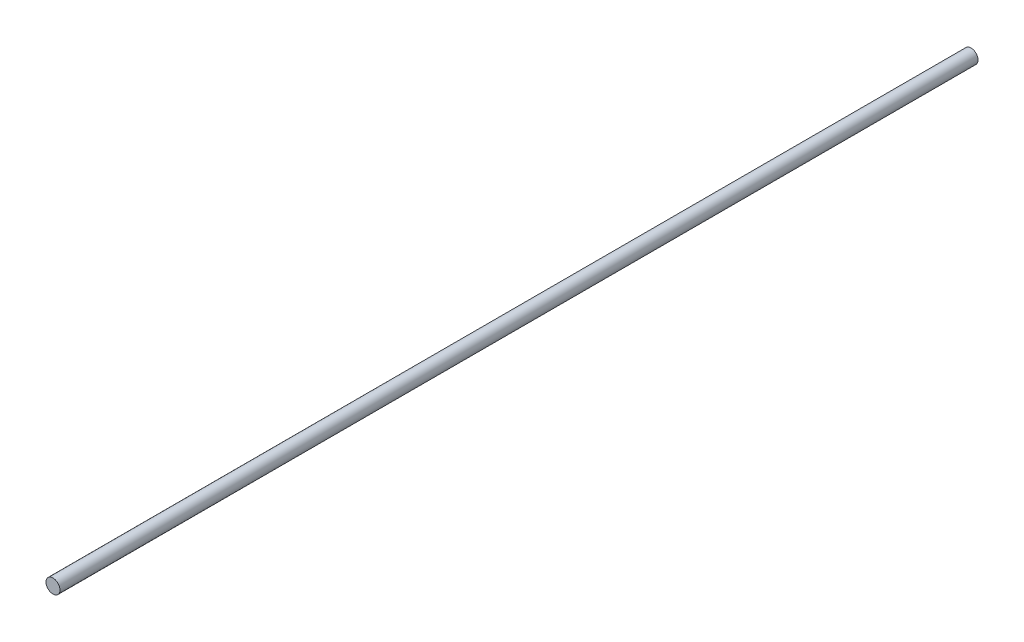
ISO-10303-21;
HEADER;
FILE_DESCRIPTION(('STEP AP214'),'2;1');
FILE_NAME('part.step','',(''),(''),'','','');
FILE_SCHEMA(('AUTOMOTIVE_DESIGN { 1 0 10303 214 1 1 1 1 }'));
ENDSEC;
DATA;
#1=APPLICATION_CONTEXT('core data for automotive mechanical design processes');
#2=APPLICATION_PROTOCOL_DEFINITION('international standard','automotive_design',2000,#1);
#3=PRODUCT_CONTEXT('',#1,'mechanical');
#4=PRODUCT('Part','Part','',(#3));
#5=PRODUCT_RELATED_PRODUCT_CATEGORY('part','',(#4));
#6=PRODUCT_DEFINITION_FORMATION('','',#4);
#7=PRODUCT_DEFINITION_CONTEXT('part definition',#1,'design');
#8=PRODUCT_DEFINITION('design','',#6,#7);
#9=PRODUCT_DEFINITION_SHAPE('','',#8);
#10=(LENGTH_UNIT() NAMED_UNIT(*) SI_UNIT(.MILLI.,.METRE.));
#11=(NAMED_UNIT(*) PLANE_ANGLE_UNIT() SI_UNIT($,.RADIAN.));
#12=(NAMED_UNIT(*) SI_UNIT($,.STERADIAN.) SOLID_ANGLE_UNIT());
#13=UNCERTAINTY_MEASURE_WITH_UNIT(LENGTH_MEASURE(1.E-05),#10,'distance_accuracy_value','');
#14=(GEOMETRIC_REPRESENTATION_CONTEXT(3) GLOBAL_UNCERTAINTY_ASSIGNED_CONTEXT((#13)) GLOBAL_UNIT_ASSIGNED_CONTEXT((#10,
#11,#12)) REPRESENTATION_CONTEXT('',''));
#15=CARTESIAN_POINT('',(0.,0.,0.));
#16=DIRECTION('',(0.,0.,1.));
#17=DIRECTION('',(1.,0.,0.));
#18=AXIS2_PLACEMENT_3D('',#15,#16,#17);
#19=CARTESIAN_POINT('',(0.,0.,635.));
#20=DIRECTION('',(0.,0.,-1.));
#21=DIRECTION('',(-1.,0.,0.));
#22=AXIS2_PLACEMENT_3D('',#19,#20,#21);
#23=CYLINDRICAL_SURFACE('',#22,4.826);
#24=CARTESIAN_POINT('',(0.,0.,635.));
#25=DIRECTION('',(0.,0.,1.));
#26=DIRECTION('',(1.,0.,0.));
#27=AXIS2_PLACEMENT_3D('',#24,#25,#26);
#28=CIRCLE('',#27,4.826);
#29=CARTESIAN_POINT('',(4.826,0.,635.));
#30=VERTEX_POINT('',#29);
#31=EDGE_CURVE('E10',#30,#30,#28,.T.);
#32=ORIENTED_EDGE('',*,*,#31,.F.);
#33=EDGE_LOOP('',(#32));
#34=FACE_BOUND('',#33,.T.);
#35=CARTESIAN_POINT('',(0.,0.,0.));
#36=DIRECTION('',(0.,0.,1.));
#37=DIRECTION('',(1.,0.,0.));
#38=AXIS2_PLACEMENT_3D('',#35,#36,#37);
#39=CIRCLE('',#38,4.826);
#40=CARTESIAN_POINT('',(4.826,0.,0.));
#41=VERTEX_POINT('',#40);
#42=EDGE_CURVE('E34',#41,#41,#39,.T.);
#43=ORIENTED_EDGE('',*,*,#42,.T.);
#44=EDGE_LOOP('',(#43));
#45=FACE_BOUND('',#44,.T.);
#46=ADVANCED_FACE('F31',(#34,#45),#23,.T.);
#47=CARTESIAN_POINT('',(0.,0.,635.));
#48=DIRECTION('',(0.,0.,1.));
#49=DIRECTION('',(1.,0.,0.));
#50=AXIS2_PLACEMENT_3D('',#47,#48,#49);
#51=PLANE('',#50);
#52=ORIENTED_EDGE('',*,*,#31,.T.);
#53=EDGE_LOOP('',(#52));
#54=FACE_BOUND('',#53,.T.);
#55=ADVANCED_FACE('F46',(#54),#51,.T.);
#56=CARTESIAN_POINT('',(0.,0.,0.));
#57=DIRECTION('',(0.,0.,1.));
#58=DIRECTION('',(1.,0.,0.));
#59=AXIS2_PLACEMENT_3D('',#56,#57,#58);
#60=PLANE('',#59);
#61=ORIENTED_EDGE('',*,*,#42,.F.);
#62=EDGE_LOOP('',(#61));
#63=FACE_BOUND('',#62,.T.);
#64=ADVANCED_FACE('F44',(#63),#60,.F.);
#65=CLOSED_SHELL('',(#46,#55,#64));
#66=MANIFOLD_SOLID_BREP('B2',#65);
#67=ADVANCED_BREP_SHAPE_REPRESENTATION('',(#18,#66),#14);
#68=SHAPE_DEFINITION_REPRESENTATION(#9,#67);
ENDSEC;
END-ISO-10303-21;
